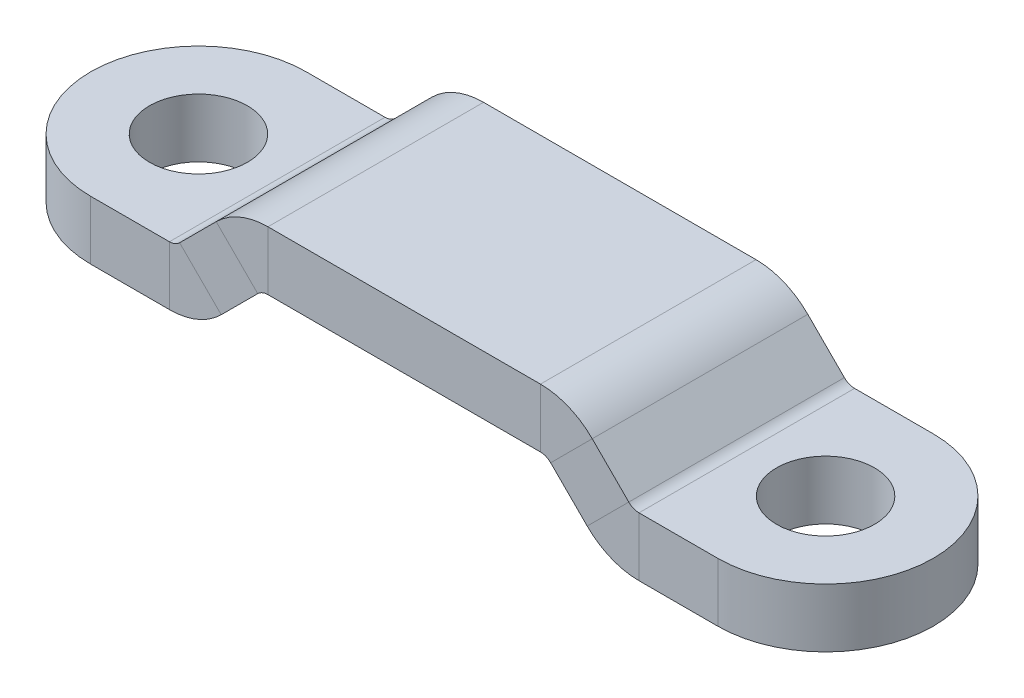
ISO-10303-21;
HEADER;
FILE_DESCRIPTION(('STEP AP214'),'2;1');
FILE_NAME('part.step','',(''),(''),'','','');
FILE_SCHEMA(('AUTOMOTIVE_DESIGN { 1 0 10303 214 1 1 1 1 }'));
ENDSEC;
DATA;
#1=APPLICATION_CONTEXT('core data for automotive mechanical design processes');
#2=APPLICATION_PROTOCOL_DEFINITION('international standard','automotive_design',2000,#1);
#3=PRODUCT_CONTEXT('',#1,'mechanical');
#4=PRODUCT('Part','Part','',(#3));
#5=PRODUCT_RELATED_PRODUCT_CATEGORY('part','',(#4));
#6=PRODUCT_DEFINITION_FORMATION('','',#4);
#7=PRODUCT_DEFINITION_CONTEXT('part definition',#1,'design');
#8=PRODUCT_DEFINITION('design','',#6,#7);
#9=PRODUCT_DEFINITION_SHAPE('','',#8);
#10=(LENGTH_UNIT() NAMED_UNIT(*) SI_UNIT(.MILLI.,.METRE.));
#11=(NAMED_UNIT(*) PLANE_ANGLE_UNIT() SI_UNIT($,.RADIAN.));
#12=(NAMED_UNIT(*) SI_UNIT($,.STERADIAN.) SOLID_ANGLE_UNIT());
#13=UNCERTAINTY_MEASURE_WITH_UNIT(LENGTH_MEASURE(1.E-05),#10,'distance_accuracy_value','');
#14=(GEOMETRIC_REPRESENTATION_CONTEXT(3) GLOBAL_UNCERTAINTY_ASSIGNED_CONTEXT((#13)) GLOBAL_UNIT_ASSIGNED_CONTEXT((#10,
#11,#12)) REPRESENTATION_CONTEXT('',''));
#15=CARTESIAN_POINT('',(0.,0.,0.));
#16=DIRECTION('',(0.,0.,1.));
#17=DIRECTION('',(1.,0.,0.));
#18=AXIS2_PLACEMENT_3D('',#15,#16,#17);
#19=CARTESIAN_POINT('',(-16.,3.,-5.5));
#20=DIRECTION('',(0.,0.,1.));
#21=DIRECTION('',(1.,0.,0.));
#22=AXIS2_PLACEMENT_3D('',#19,#20,#21);
#23=PLANE('',#22);
#24=DIRECTION('',(-1.,0.,0.));
#25=VECTOR('',#24,1.);
#26=CARTESIAN_POINT('',(-16.,3.,-5.5));
#27=LINE('',#26,#25);
#28=CARTESIAN_POINT('',(6.95224960283671,3.,-5.50000000000001));
#29=VERTEX_POINT('',#28);
#30=CARTESIAN_POINT('',(-6.9522496028367,3.,-5.5));
#31=VERTEX_POINT('',#30);
#32=EDGE_CURVE('E336',#29,#31,#27,.T.);
#33=ORIENTED_EDGE('',*,*,#32,.F.);
#34=DIRECTION('',(0.,-1.,0.));
#35=VECTOR('',#34,1.);
#36=CARTESIAN_POINT('',(6.95224960283671,3.,-5.5));
#37=LINE('',#36,#35);
#38=CARTESIAN_POINT('',(6.95224960283671,0.,-5.5));
#39=VERTEX_POINT('',#38);
#40=EDGE_CURVE('E386',#29,#39,#37,.T.);
#41=ORIENTED_EDGE('',*,*,#40,.T.);
#42=DIRECTION('',(-1.,0.,0.));
#43=VECTOR('',#42,1.);
#44=CARTESIAN_POINT('',(-16.,0.,-5.5));
#45=LINE('',#44,#43);
#46=CARTESIAN_POINT('',(-6.9522496028367,0.,-5.5));
#47=VERTEX_POINT('',#46);
#48=EDGE_CURVE('E378',#39,#47,#45,.T.);
#49=ORIENTED_EDGE('',*,*,#48,.T.);
#50=DIRECTION('',(0.,-1.,0.));
#51=VECTOR('',#50,1.);
#52=CARTESIAN_POINT('',(-6.9522496028367,3.,-5.5));
#53=LINE('',#52,#51);
#54=EDGE_CURVE('E327',#31,#47,#53,.T.);
#55=ORIENTED_EDGE('',*,*,#54,.F.);
#56=EDGE_LOOP('',(#33,#41,#49,#55));
#57=FACE_BOUND('',#56,.T.);
#58=ADVANCED_FACE('F49',(#57),#23,.F.);
#59=CARTESIAN_POINT('',(-16.,0.,0.));
#60=DIRECTION('',(0.,1.,0.));
#61=DIRECTION('',(0.,0.,1.));
#62=AXIS2_PLACEMENT_3D('',#59,#60,#61);
#63=PLANE('',#62);
#64=ORIENTED_EDGE('',*,*,#48,.F.);
#65=DIRECTION('',(0.,0.,1.));
#66=VECTOR('',#65,1.);
#67=CARTESIAN_POINT('',(6.95224960283671,0.,0.));
#68=LINE('',#67,#66);
#69=CARTESIAN_POINT('',(6.95224960283671,0.,5.49999999999999));
#70=VERTEX_POINT('',#69);
#71=EDGE_CURVE('E383',#39,#70,#68,.T.);
#72=ORIENTED_EDGE('',*,*,#71,.T.);
#73=DIRECTION('',(1.,0.,0.));
#74=VECTOR('',#73,1.);
#75=CARTESIAN_POINT('',(-16.,0.,5.5));
#76=LINE('',#75,#74);
#77=CARTESIAN_POINT('',(-6.9522496028367,0.,5.5));
#78=VERTEX_POINT('',#77);
#79=EDGE_CURVE('E391',#78,#70,#76,.T.);
#80=ORIENTED_EDGE('',*,*,#79,.F.);
#81=DIRECTION('',(0.,0.,1.));
#82=VECTOR('',#81,1.);
#83=CARTESIAN_POINT('',(-6.9522496028367,0.,0.));
#84=LINE('',#83,#82);
#85=EDGE_CURVE('E340',#47,#78,#84,.T.);
#86=ORIENTED_EDGE('',*,*,#85,.F.);
#87=EDGE_LOOP('',(#64,#72,#80,#86));
#88=FACE_BOUND('',#87,.T.);
#89=ADVANCED_FACE('F446',(#88),#63,.F.);
#90=CARTESIAN_POINT('',(-16.,3.,5.5));
#91=DIRECTION('',(0.,0.,-1.));
#92=DIRECTION('',(-1.,0.,0.));
#93=AXIS2_PLACEMENT_3D('',#90,#91,#92);
#94=PLANE('',#93);
#95=ORIENTED_EDGE('',*,*,#79,.T.);
#96=DIRECTION('',(0.,1.,0.));
#97=VECTOR('',#96,1.);
#98=CARTESIAN_POINT('',(6.95224960283671,3.,5.5));
#99=LINE('',#98,#97);
#100=CARTESIAN_POINT('',(6.95224960283671,3.,5.49999999999999));
#101=VERTEX_POINT('',#100);
#102=EDGE_CURVE('E380',#70,#101,#99,.T.);
#103=ORIENTED_EDGE('',*,*,#102,.T.);
#104=DIRECTION('',(1.,0.,0.));
#105=VECTOR('',#104,1.);
#106=CARTESIAN_POINT('',(-16.,3.,5.5));
#107=LINE('',#106,#105);
#108=CARTESIAN_POINT('',(-6.9522496028367,3.,5.5));
#109=VERTEX_POINT('',#108);
#110=EDGE_CURVE('E335',#109,#101,#107,.T.);
#111=ORIENTED_EDGE('',*,*,#110,.F.);
#112=DIRECTION('',(0.,1.,0.));
#113=VECTOR('',#112,1.);
#114=CARTESIAN_POINT('',(-6.9522496028367,3.,5.5));
#115=LINE('',#114,#113);
#116=EDGE_CURVE('E337',#78,#109,#115,.T.);
#117=ORIENTED_EDGE('',*,*,#116,.F.);
#118=EDGE_LOOP('',(#95,#103,#111,#117));
#119=FACE_BOUND('',#118,.T.);
#120=ADVANCED_FACE('F452',(#119),#94,.F.);
#121=CARTESIAN_POINT('',(-14.7500314643002,-3.25003146430018,0.));
#122=DIRECTION('',(-0.707106781186549,0.707106781186546,0.));
#123=DIRECTION('',(0.,0.,1.));
#124=AXIS2_PLACEMENT_3D('',#121,#122,#123);
#125=PLANE('',#124);
#126=DIRECTION('',(-0.707106781186546,-0.707106781186549,0.));
#127=VECTOR('',#126,1.);
#128=CARTESIAN_POINT('',(-14.7500314643002,-3.25003146430018,-5.5));
#129=LINE('',#128,#127);
#130=CARTESIAN_POINT('',(-9.59442480141836,1.90557519858165,-5.5));
#131=VERTEX_POINT('',#130);
#132=CARTESIAN_POINT('',(-11.459254855022,0.0407451449779793,-5.5));
#133=VERTEX_POINT('',#132);
#134=EDGE_CURVE('E376',#131,#133,#129,.T.);
#135=ORIENTED_EDGE('',*,*,#134,.T.);
#136=DIRECTION('',(0.,0.,1.));
#137=VECTOR('',#136,1.);
#138=CARTESIAN_POINT('',(-11.459254855022,0.0407451449779793,0.));
#139=LINE('',#138,#137);
#140=CARTESIAN_POINT('',(-11.459254855022,0.0407451449779785,5.5));
#141=VERTEX_POINT('',#140);
#142=EDGE_CURVE('E357',#133,#141,#139,.T.);
#143=ORIENTED_EDGE('',*,*,#142,.T.);
#144=DIRECTION('',(0.707106781186546,0.707106781186549,0.));
#145=VECTOR('',#144,1.);
#146=CARTESIAN_POINT('',(-14.7500314643002,-3.25003146430018,5.5));
#147=LINE('',#146,#145);
#148=CARTESIAN_POINT('',(-9.59442480141836,1.90557519858165,5.5));
#149=VERTEX_POINT('',#148);
#150=EDGE_CURVE('E372',#141,#149,#147,.T.);
#151=ORIENTED_EDGE('',*,*,#150,.T.);
#152=DIRECTION('',(0.,0.,1.));
#153=VECTOR('',#152,1.);
#154=CARTESIAN_POINT('',(-9.59442480141836,1.90557519858165,0.));
#155=LINE('',#154,#153);
#156=EDGE_CURVE('E345',#131,#149,#155,.T.);
#157=ORIENTED_EDGE('',*,*,#156,.F.);
#158=EDGE_LOOP('',(#135,#143,#151,#157));
#159=FACE_BOUND('',#158,.T.);
#160=ADVANCED_FACE('F462',(#159),#125,.T.);
#161=CARTESIAN_POINT('',(-12.6287111207405,-5.37135180785982,0.));
#162=DIRECTION('',(-0.707106781186549,0.707106781186546,0.));
#163=DIRECTION('',(0.,0.,1.));
#164=AXIS2_PLACEMENT_3D('',#161,#162,#163);
#165=PLANE('',#164);
#166=DIRECTION('',(0.,0.,1.));
#167=VECTOR('',#166,1.);
#168=CARTESIAN_POINT('',(-9.33793451146238,-2.08057519858166,0.));
#169=LINE('',#168,#167);
#170=CARTESIAN_POINT('',(-9.33793451146238,-2.08057519858166,-5.5));
#171=VERTEX_POINT('',#170);
#172=CARTESIAN_POINT('',(-9.33793451146238,-2.08057519858166,5.5));
#173=VERTEX_POINT('',#172);
#174=EDGE_CURVE('E363',#171,#173,#169,.T.);
#175=ORIENTED_EDGE('',*,*,#174,.F.);
#176=DIRECTION('',(-0.707106781186546,-0.707106781186549,0.));
#177=VECTOR('',#176,1.);
#178=CARTESIAN_POINT('',(-12.6287111207405,-5.37135180785982,-5.5));
#179=LINE('',#178,#177);
#180=CARTESIAN_POINT('',(-7.47310445785872,-0.21574514497799,-5.5));
#181=VERTEX_POINT('',#180);
#182=EDGE_CURVE('E349',#181,#171,#179,.T.);
#183=ORIENTED_EDGE('',*,*,#182,.F.);
#184=DIRECTION('',(0.,0.,1.));
#185=VECTOR('',#184,1.);
#186=CARTESIAN_POINT('',(-7.47310445785872,-0.21574514497799,0.));
#187=LINE('',#186,#185);
#188=CARTESIAN_POINT('',(-7.47310445785872,-0.21574514497799,5.5));
#189=VERTEX_POINT('',#188);
#190=EDGE_CURVE('E351',#181,#189,#187,.T.);
#191=ORIENTED_EDGE('',*,*,#190,.T.);
#192=DIRECTION('',(0.707106781186546,0.707106781186549,0.));
#193=VECTOR('',#192,1.);
#194=CARTESIAN_POINT('',(-12.6287111207405,-5.37135180785982,5.5));
#195=LINE('',#194,#193);
#196=EDGE_CURVE('E370',#173,#189,#195,.T.);
#197=ORIENTED_EDGE('',*,*,#196,.F.);
#198=EDGE_LOOP('',(#175,#183,#191,#197));
#199=FACE_BOUND('',#198,.T.);
#200=ADVANCED_FACE('F508',(#199),#165,.F.);
#201=CARTESIAN_POINT('',(-14.7500314643002,-3.25003146430018,5.5));
#202=DIRECTION('',(0.,0.,-1.));
#203=DIRECTION('',(-0.707106781186546,-0.707106781186549,0.));
#204=AXIS2_PLACEMENT_3D('',#201,#202,#203);
#205=PLANE('',#204);
#206=DIRECTION('',(-0.707106781186549,0.707106781186546,0.));
#207=VECTOR('',#206,1.);
#208=CARTESIAN_POINT('',(-11.459254855022,0.0407451449779793,5.5));
#209=LINE('',#208,#207);
#210=EDGE_CURVE('E366',#173,#141,#209,.T.);
#211=ORIENTED_EDGE('',*,*,#210,.F.);
#212=ORIENTED_EDGE('',*,*,#196,.T.);
#213=DIRECTION('',(-0.707106781186549,0.707106781186546,0.));
#214=VECTOR('',#213,1.);
#215=CARTESIAN_POINT('',(-9.59442480141836,1.90557519858165,5.5));
#216=LINE('',#215,#214);
#217=EDGE_CURVE('E348',#189,#149,#216,.T.);
#218=ORIENTED_EDGE('',*,*,#217,.T.);
#219=ORIENTED_EDGE('',*,*,#150,.F.);
#220=EDGE_LOOP('',(#211,#212,#218,#219));
#221=FACE_BOUND('',#220,.T.);
#222=ADVANCED_FACE('F457',(#221),#205,.F.);
#223=CARTESIAN_POINT('',(-14.7500314643002,-3.25003146430018,-5.5));
#224=DIRECTION('',(0.,0.,1.));
#225=DIRECTION('',(0.707106781186546,0.707106781186549,0.));
#226=AXIS2_PLACEMENT_3D('',#223,#224,#225);
#227=PLANE('',#226);
#228=DIRECTION('',(0.707106781186549,-0.707106781186546,0.));
#229=VECTOR('',#228,1.);
#230=CARTESIAN_POINT('',(-11.459254855022,0.0407451449779793,-5.5));
#231=LINE('',#230,#229);
#232=EDGE_CURVE('E360',#133,#171,#231,.T.);
#233=ORIENTED_EDGE('',*,*,#232,.F.);
#234=ORIENTED_EDGE('',*,*,#134,.F.);
#235=DIRECTION('',(0.707106781186549,-0.707106781186546,0.));
#236=VECTOR('',#235,1.);
#237=CARTESIAN_POINT('',(-9.59442480141836,1.90557519858165,-5.5));
#238=LINE('',#237,#236);
#239=EDGE_CURVE('E354',#131,#181,#238,.T.);
#240=ORIENTED_EDGE('',*,*,#239,.T.);
#241=ORIENTED_EDGE('',*,*,#182,.T.);
#242=EDGE_LOOP('',(#233,#234,#240,#241));
#243=FACE_BOUND('',#242,.T.);
#244=ADVANCED_FACE('F468',(#243),#227,.F.);
#245=CARTESIAN_POINT('',(-16.,3.,0.));
#246=DIRECTION('',(0.,1.,0.));
#247=DIRECTION('',(0.,0.,1.));
#248=AXIS2_PLACEMENT_3D('',#245,#246,#247);
#249=PLANE('',#248);
#250=DIRECTION('',(0.,0.,1.));
#251=VECTOR('',#250,1.);
#252=CARTESIAN_POINT('',(6.95224960283671,3.,0.));
#253=LINE('',#252,#251);
#254=EDGE_CURVE('E369',#29,#101,#253,.T.);
#255=ORIENTED_EDGE('',*,*,#254,.F.);
#256=ORIENTED_EDGE('',*,*,#32,.T.);
#257=DIRECTION('',(0.,0.,1.));
#258=VECTOR('',#257,1.);
#259=CARTESIAN_POINT('',(-6.9522496028367,3.,0.));
#260=LINE('',#259,#258);
#261=EDGE_CURVE('E332',#31,#109,#260,.T.);
#262=ORIENTED_EDGE('',*,*,#261,.T.);
#263=ORIENTED_EDGE('',*,*,#110,.T.);
#264=EDGE_LOOP('',(#255,#256,#262,#263));
#265=FACE_BOUND('',#264,.T.);
#266=ADVANCED_FACE('F464',(#265),#249,.T.);
#267=CARTESIAN_POINT('',(-6.9522496028367,-0.7366,-5.5));
#268=DIRECTION('',(0.,0.,-1.));
#269=DIRECTION('',(-1.,0.,0.));
#270=AXIS2_PLACEMENT_3D('',#267,#268,#269);
#271=PLANE('',#270);
#272=ORIENTED_EDGE('',*,*,#54,.T.);
#273=CARTESIAN_POINT('',(-6.9522496028367,-0.7366,-5.5));
#274=DIRECTION('',(0.,0.,1.));
#275=DIRECTION('',(1.,0.,0.));
#276=AXIS2_PLACEMENT_3D('',#273,#274,#275);
#277=CIRCLE('',#276,0.7366);
#278=EDGE_CURVE('E315',#47,#181,#277,.T.);
#279=ORIENTED_EDGE('',*,*,#278,.T.);
#280=ORIENTED_EDGE('',*,*,#239,.F.);
#281=CARTESIAN_POINT('',(-6.9522496028367,-0.7366,-5.5));
#282=DIRECTION('',(0.,0.,1.));
#283=DIRECTION('',(1.,0.,0.));
#284=AXIS2_PLACEMENT_3D('',#281,#282,#283);
#285=CIRCLE('',#284,3.7366);
#286=EDGE_CURVE('E320',#31,#131,#285,.T.);
#287=ORIENTED_EDGE('',*,*,#286,.F.);
#288=EDGE_LOOP('',(#272,#279,#280,#287));
#289=FACE_BOUND('',#288,.T.);
#290=ADVANCED_FACE('F467',(#289),#271,.T.);
#291=CARTESIAN_POINT('',(-6.9522496028367,-0.7366,5.5));
#292=DIRECTION('',(0.,0.,1.));
#293=DIRECTION('',(1.,0.,0.));
#294=AXIS2_PLACEMENT_3D('',#291,#292,#293);
#295=PLANE('',#294);
#296=ORIENTED_EDGE('',*,*,#217,.F.);
#297=CARTESIAN_POINT('',(-6.9522496028367,-0.7366,5.5));
#298=DIRECTION('',(0.,0.,1.));
#299=DIRECTION('',(1.,0.,0.));
#300=AXIS2_PLACEMENT_3D('',#297,#298,#299);
#301=CIRCLE('',#300,0.7366);
#302=EDGE_CURVE('E324',#189,#78,#301,.F.);
#303=ORIENTED_EDGE('',*,*,#302,.T.);
#304=ORIENTED_EDGE('',*,*,#116,.T.);
#305=CARTESIAN_POINT('',(-6.9522496028367,-0.7366,5.5));
#306=DIRECTION('',(0.,0.,-1.));
#307=DIRECTION('',(-1.,0.,0.));
#308=AXIS2_PLACEMENT_3D('',#305,#306,#307);
#309=CIRCLE('',#308,3.7366);
#310=EDGE_CURVE('E323',#149,#109,#309,.T.);
#311=ORIENTED_EDGE('',*,*,#310,.F.);
#312=EDGE_LOOP('',(#296,#303,#304,#311));
#313=FACE_BOUND('',#312,.T.);
#314=ADVANCED_FACE('F512',(#313),#295,.T.);
#315=CARTESIAN_POINT('',(-6.9522496028367,-0.7366,-11.5362783950276));
#316=DIRECTION('',(0.,0.,1.));
#317=DIRECTION('',(1.,0.,0.));
#318=AXIS2_PLACEMENT_3D('',#315,#316,#317);
#319=CYLINDRICAL_SURFACE('',#318,3.7366);
#320=ORIENTED_EDGE('',*,*,#310,.T.);
#321=ORIENTED_EDGE('',*,*,#261,.F.);
#322=ORIENTED_EDGE('',*,*,#286,.T.);
#323=ORIENTED_EDGE('',*,*,#156,.T.);
#324=EDGE_LOOP('',(#320,#321,#322,#323));
#325=FACE_BOUND('',#324,.T.);
#326=ADVANCED_FACE('F518',(#325),#319,.T.);
#327=CARTESIAN_POINT('',(-6.9522496028367,-0.7366,-11.5362783950276));
#328=DIRECTION('',(0.,0.,1.));
#329=DIRECTION('',(1.,0.,0.));
#330=AXIS2_PLACEMENT_3D('',#327,#328,#329);
#331=CYLINDRICAL_SURFACE('',#330,0.7366);
#332=ORIENTED_EDGE('',*,*,#302,.F.);
#333=ORIENTED_EDGE('',*,*,#190,.F.);
#334=ORIENTED_EDGE('',*,*,#278,.F.);
#335=ORIENTED_EDGE('',*,*,#85,.T.);
#336=EDGE_LOOP('',(#332,#333,#334,#335));
#337=FACE_BOUND('',#336,.T.);
#338=ADVANCED_FACE('F504',(#337),#331,.F.);
#339=CARTESIAN_POINT('',(-11.980109710044,0.561599999999989,-5.5));
#340=DIRECTION('',(0.,0.,1.));
#341=DIRECTION('',(1.,0.,0.));
#342=AXIS2_PLACEMENT_3D('',#339,#340,#341);
#343=PLANE('',#342);
#344=ORIENTED_EDGE('',*,*,#232,.T.);
#345=CARTESIAN_POINT('',(-11.980109710044,0.561599999999989,-5.5));
#346=DIRECTION('',(0.,0.,1.));
#347=DIRECTION('',(1.,0.,0.));
#348=AXIS2_PLACEMENT_3D('',#345,#346,#347);
#349=CIRCLE('',#348,3.7366);
#350=CARTESIAN_POINT('',(-11.980109710044,-3.17500000000001,-5.5));
#351=VERTEX_POINT('',#350);
#352=EDGE_CURVE('E273',#171,#351,#349,.F.);
#353=ORIENTED_EDGE('',*,*,#352,.T.);
#354=DIRECTION('',(0.,-1.,0.));
#355=VECTOR('',#354,1.);
#356=CARTESIAN_POINT('',(-11.980109710044,-0.175000000000012,-5.5));
#357=LINE('',#356,#355);
#358=CARTESIAN_POINT('',(-11.980109710044,-0.175000000000012,-5.5));
#359=VERTEX_POINT('',#358);
#360=EDGE_CURVE('E286',#359,#351,#357,.T.);
#361=ORIENTED_EDGE('',*,*,#360,.F.);
#362=CARTESIAN_POINT('',(-11.980109710044,0.561599999999989,-5.5));
#363=DIRECTION('',(0.,0.,-1.));
#364=DIRECTION('',(-1.,0.,0.));
#365=AXIS2_PLACEMENT_3D('',#362,#363,#364);
#366=CIRCLE('',#365,0.7366);
#367=EDGE_CURVE('E308',#133,#359,#366,.T.);
#368=ORIENTED_EDGE('',*,*,#367,.F.);
#369=EDGE_LOOP('',(#344,#353,#361,#368));
#370=FACE_BOUND('',#369,.T.);
#371=ADVANCED_FACE('F525',(#370),#343,.F.);
#372=CARTESIAN_POINT('',(-11.980109710044,0.561599999999989,5.5));
#373=DIRECTION('',(0.,0.,-1.));
#374=DIRECTION('',(-1.,0.,0.));
#375=AXIS2_PLACEMENT_3D('',#372,#373,#374);
#376=PLANE('',#375);
#377=DIRECTION('',(0.,1.,0.));
#378=VECTOR('',#377,1.);
#379=CARTESIAN_POINT('',(-11.980109710044,-0.175000000000012,5.5));
#380=LINE('',#379,#378);
#381=CARTESIAN_POINT('',(-11.980109710044,-3.17500000000001,5.5));
#382=VERTEX_POINT('',#381);
#383=CARTESIAN_POINT('',(-11.980109710044,-0.175000000000011,5.5));
#384=VERTEX_POINT('',#383);
#385=EDGE_CURVE('E274',#382,#384,#380,.T.);
#386=ORIENTED_EDGE('',*,*,#385,.F.);
#387=CARTESIAN_POINT('',(-11.980109710044,0.561599999999989,5.5));
#388=DIRECTION('',(0.,0.,1.));
#389=DIRECTION('',(1.,0.,0.));
#390=AXIS2_PLACEMENT_3D('',#387,#388,#389);
#391=CIRCLE('',#390,3.7366);
#392=EDGE_CURVE('E312',#382,#173,#391,.T.);
#393=ORIENTED_EDGE('',*,*,#392,.T.);
#394=ORIENTED_EDGE('',*,*,#210,.T.);
#395=CARTESIAN_POINT('',(-11.980109710044,0.561599999999989,5.5));
#396=DIRECTION('',(0.,0.,1.));
#397=DIRECTION('',(1.,0.,0.));
#398=AXIS2_PLACEMENT_3D('',#395,#396,#397);
#399=CIRCLE('',#398,0.7366);
#400=EDGE_CURVE('E311',#384,#141,#399,.T.);
#401=ORIENTED_EDGE('',*,*,#400,.F.);
#402=EDGE_LOOP('',(#386,#393,#394,#401));
#403=FACE_BOUND('',#402,.T.);
#404=ADVANCED_FACE('F585',(#403),#376,.F.);
#405=CARTESIAN_POINT('',(-11.980109710044,0.561599999999989,-11.9843835219468));
#406=DIRECTION('',(0.,0.,1.));
#407=DIRECTION('',(1.,0.,0.));
#408=AXIS2_PLACEMENT_3D('',#405,#406,#407);
#409=CYLINDRICAL_SURFACE('',#408,0.7366);
#410=ORIENTED_EDGE('',*,*,#400,.T.);
#411=ORIENTED_EDGE('',*,*,#142,.F.);
#412=ORIENTED_EDGE('',*,*,#367,.T.);
#413=DIRECTION('',(0.,0.,1.));
#414=VECTOR('',#413,1.);
#415=CARTESIAN_POINT('',(-11.980109710044,-0.175000000000012,0.));
#416=LINE('',#415,#414);
#417=EDGE_CURVE('E265',#359,#384,#416,.T.);
#418=ORIENTED_EDGE('',*,*,#417,.T.);
#419=EDGE_LOOP('',(#410,#411,#412,#418));
#420=FACE_BOUND('',#419,.T.);
#421=ADVANCED_FACE('F595',(#420),#409,.F.);
#422=CARTESIAN_POINT('',(-11.980109710044,0.561599999999989,-11.9843835219468));
#423=DIRECTION('',(0.,0.,1.));
#424=DIRECTION('',(1.,0.,0.));
#425=AXIS2_PLACEMENT_3D('',#422,#423,#424);
#426=CYLINDRICAL_SURFACE('',#425,3.7366);
#427=ORIENTED_EDGE('',*,*,#392,.F.);
#428=DIRECTION('',(0.,0.,1.));
#429=VECTOR('',#428,1.);
#430=CARTESIAN_POINT('',(-11.980109710044,-3.17500000000001,0.));
#431=LINE('',#430,#429);
#432=EDGE_CURVE('E278',#351,#382,#431,.T.);
#433=ORIENTED_EDGE('',*,*,#432,.F.);
#434=ORIENTED_EDGE('',*,*,#352,.F.);
#435=ORIENTED_EDGE('',*,*,#174,.T.);
#436=EDGE_LOOP('',(#427,#433,#434,#435));
#437=FACE_BOUND('',#436,.T.);
#438=ADVANCED_FACE('F605',(#437),#426,.T.);
#439=CARTESIAN_POINT('',(-16.,-0.17500000000001,0.));
#440=DIRECTION('',(0.,-1.,0.));
#441=DIRECTION('',(0.,0.,-1.));
#442=AXIS2_PLACEMENT_3D('',#439,#440,#441);
#443=CYLINDRICAL_SURFACE('',#442,2.5);
#444=CARTESIAN_POINT('',(-16.,-0.17500000000001,0.));
#445=DIRECTION('',(0.,1.,0.));
#446=DIRECTION('',(0.,0.,1.));
#447=AXIS2_PLACEMENT_3D('',#444,#445,#446);
#448=CIRCLE('',#447,2.5);
#449=CARTESIAN_POINT('',(-16.,-0.17500000000001,2.5));
#450=VERTEX_POINT('',#449);
#451=EDGE_CURVE('E303',#450,#450,#448,.T.);
#452=ORIENTED_EDGE('',*,*,#451,.T.);
#453=EDGE_LOOP('',(#452));
#454=FACE_BOUND('',#453,.T.);
#455=CARTESIAN_POINT('',(-16.,-3.17500000000001,0.));
#456=DIRECTION('',(0.,1.,0.));
#457=DIRECTION('',(0.,0.,1.));
#458=AXIS2_PLACEMENT_3D('',#455,#456,#457);
#459=CIRCLE('',#458,2.5);
#460=CARTESIAN_POINT('',(-16.,-3.17500000000001,2.5));
#461=VERTEX_POINT('',#460);
#462=EDGE_CURVE('E281',#461,#461,#459,.T.);
#463=ORIENTED_EDGE('',*,*,#462,.F.);
#464=EDGE_LOOP('',(#463));
#465=FACE_BOUND('',#464,.T.);
#466=ADVANCED_FACE('F616',(#454,#465),#443,.F.);
#467=CARTESIAN_POINT('',(-16.,-0.17500000000001,0.));
#468=DIRECTION('',(0.,-1.,0.));
#469=DIRECTION('',(0.,0.,-1.));
#470=AXIS2_PLACEMENT_3D('',#467,#468,#469);
#471=CYLINDRICAL_SURFACE('',#470,5.5);
#472=CARTESIAN_POINT('',(-16.,-3.17500000000001,0.));
#473=DIRECTION('',(0.,1.,0.));
#474=DIRECTION('',(0.,0.,1.));
#475=AXIS2_PLACEMENT_3D('',#472,#473,#474);
#476=CIRCLE('',#475,5.5);
#477=CARTESIAN_POINT('',(-16.,-3.17500000000001,-5.5));
#478=VERTEX_POINT('',#477);
#479=CARTESIAN_POINT('',(-16.,-3.17500000000001,5.5));
#480=VERTEX_POINT('',#479);
#481=EDGE_CURVE('E300',#478,#480,#476,.T.);
#482=ORIENTED_EDGE('',*,*,#481,.T.);
#483=DIRECTION('',(0.,-1.,0.));
#484=VECTOR('',#483,1.);
#485=CARTESIAN_POINT('',(-16.,-0.17500000000001,5.5));
#486=LINE('',#485,#484);
#487=CARTESIAN_POINT('',(-16.,-0.17500000000001,5.5));
#488=VERTEX_POINT('',#487);
#489=EDGE_CURVE('E270',#488,#480,#486,.T.);
#490=ORIENTED_EDGE('',*,*,#489,.F.);
#491=CARTESIAN_POINT('',(-16.,-0.17500000000001,0.));
#492=DIRECTION('',(0.,1.,0.));
#493=DIRECTION('',(0.,0.,1.));
#494=AXIS2_PLACEMENT_3D('',#491,#492,#493);
#495=CIRCLE('',#494,5.5);
#496=CARTESIAN_POINT('',(-16.,-0.17500000000001,-5.5));
#497=VERTEX_POINT('',#496);
#498=EDGE_CURVE('E292',#497,#488,#495,.T.);
#499=ORIENTED_EDGE('',*,*,#498,.F.);
#500=DIRECTION('',(0.,-1.,0.));
#501=VECTOR('',#500,1.);
#502=CARTESIAN_POINT('',(-16.,-0.17500000000001,-5.5));
#503=LINE('',#502,#501);
#504=EDGE_CURVE('E297',#497,#478,#503,.T.);
#505=ORIENTED_EDGE('',*,*,#504,.T.);
#506=EDGE_LOOP('',(#482,#490,#499,#505));
#507=FACE_BOUND('',#506,.T.);
#508=ADVANCED_FACE('F630',(#507),#471,.T.);
#509=CARTESIAN_POINT('',(-14.8773490893706,-0.175000000000012,0.));
#510=DIRECTION('',(0.,1.,0.));
#511=DIRECTION('',(0.,0.,1.));
#512=AXIS2_PLACEMENT_3D('',#509,#510,#511);
#513=PLANE('',#512);
#514=ORIENTED_EDGE('',*,*,#417,.F.);
#515=DIRECTION('',(-1.,0.,0.));
#516=VECTOR('',#515,1.);
#517=CARTESIAN_POINT('',(-14.8773490893706,-0.175000000000012,-5.5));
#518=LINE('',#517,#516);
#519=EDGE_CURVE('E295',#359,#497,#518,.T.);
#520=ORIENTED_EDGE('',*,*,#519,.T.);
#521=ORIENTED_EDGE('',*,*,#498,.T.);
#522=DIRECTION('',(1.,0.,0.));
#523=VECTOR('',#522,1.);
#524=CARTESIAN_POINT('',(-14.8773490893706,-0.175000000000012,5.5));
#525=LINE('',#524,#523);
#526=EDGE_CURVE('E289',#488,#384,#525,.T.);
#527=ORIENTED_EDGE('',*,*,#526,.T.);
#528=EDGE_LOOP('',(#514,#520,#521,#527));
#529=FACE_BOUND('',#528,.T.);
#530=ORIENTED_EDGE('',*,*,#451,.F.);
#531=EDGE_LOOP('',(#530));
#532=FACE_BOUND('',#531,.T.);
#533=ADVANCED_FACE('F625',(#529,#532),#513,.T.);
#534=CARTESIAN_POINT('',(-14.8773490893706,-0.175000000000012,-5.5));
#535=DIRECTION('',(0.,0.,1.));
#536=DIRECTION('',(1.,0.,0.));
#537=AXIS2_PLACEMENT_3D('',#534,#535,#536);
#538=PLANE('',#537);
#539=ORIENTED_EDGE('',*,*,#519,.F.);
#540=ORIENTED_EDGE('',*,*,#360,.T.);
#541=DIRECTION('',(-1.,0.,0.));
#542=VECTOR('',#541,1.);
#543=CARTESIAN_POINT('',(-14.8773490893706,-3.17500000000001,-5.5));
#544=LINE('',#543,#542);
#545=EDGE_CURVE('E284',#351,#478,#544,.T.);
#546=ORIENTED_EDGE('',*,*,#545,.T.);
#547=ORIENTED_EDGE('',*,*,#504,.F.);
#548=EDGE_LOOP('',(#539,#540,#546,#547));
#549=FACE_BOUND('',#548,.T.);
#550=ADVANCED_FACE('F629',(#549),#538,.F.);
#551=CARTESIAN_POINT('',(-14.8773490893706,-3.17500000000001,0.));
#552=DIRECTION('',(0.,1.,0.));
#553=DIRECTION('',(0.,0.,1.));
#554=AXIS2_PLACEMENT_3D('',#551,#552,#553);
#555=PLANE('',#554);
#556=ORIENTED_EDGE('',*,*,#462,.T.);
#557=EDGE_LOOP('',(#556));
#558=FACE_BOUND('',#557,.T.);
#559=ORIENTED_EDGE('',*,*,#545,.F.);
#560=ORIENTED_EDGE('',*,*,#432,.T.);
#561=DIRECTION('',(1.,0.,0.));
#562=VECTOR('',#561,1.);
#563=CARTESIAN_POINT('',(-14.8773490893706,-3.17500000000001,5.5));
#564=LINE('',#563,#562);
#565=EDGE_CURVE('E276',#480,#382,#564,.T.);
#566=ORIENTED_EDGE('',*,*,#565,.F.);
#567=ORIENTED_EDGE('',*,*,#481,.F.);
#568=EDGE_LOOP('',(#559,#560,#566,#567));
#569=FACE_BOUND('',#568,.T.);
#570=ADVANCED_FACE('F640',(#558,#569),#555,.F.);
#571=CARTESIAN_POINT('',(-14.8773490893706,-0.175000000000012,5.5));
#572=DIRECTION('',(0.,0.,-1.));
#573=DIRECTION('',(-1.,0.,0.));
#574=AXIS2_PLACEMENT_3D('',#571,#572,#573);
#575=PLANE('',#574);
#576=ORIENTED_EDGE('',*,*,#565,.T.);
#577=ORIENTED_EDGE('',*,*,#385,.T.);
#578=ORIENTED_EDGE('',*,*,#526,.F.);
#579=ORIENTED_EDGE('',*,*,#489,.T.);
#580=EDGE_LOOP('',(#576,#577,#578,#579));
#581=FACE_BOUND('',#580,.T.);
#582=ADVANCED_FACE('F644',(#581),#575,.F.);
#583=CARTESIAN_POINT('',(6.95224960283671,-0.7366,-5.50000000000001));
#584=DIRECTION('',(0.,0.,-1.));
#585=DIRECTION('',(-1.,0.,0.));
#586=AXIS2_PLACEMENT_3D('',#583,#584,#585);
#587=PLANE('',#586);
#588=DIRECTION('',(-0.707106781186549,-0.707106781186546,0.));
#589=VECTOR('',#588,1.);
#590=CARTESIAN_POINT('',(9.59442480141836,1.90557519858165,-5.5));
#591=LINE('',#590,#589);
#592=CARTESIAN_POINT('',(9.59442480141836,1.90557519858165,-5.50000000000001));
#593=VERTEX_POINT('',#592);
#594=CARTESIAN_POINT('',(7.47310445785872,-0.21574514497799,-5.5));
#595=VERTEX_POINT('',#594);
#596=EDGE_CURVE('E244',#593,#595,#591,.T.);
#597=ORIENTED_EDGE('',*,*,#596,.T.);
#598=CARTESIAN_POINT('',(6.95224960283671,-0.7366,-5.50000000000001));
#599=DIRECTION('',(0.,0.,-1.));
#600=DIRECTION('',(-1.,0.,0.));
#601=AXIS2_PLACEMENT_3D('',#598,#599,#600);
#602=CIRCLE('',#601,0.7366);
#603=EDGE_CURVE('E74',#595,#39,#602,.F.);
#604=ORIENTED_EDGE('',*,*,#603,.T.);
#605=ORIENTED_EDGE('',*,*,#40,.F.);
#606=CARTESIAN_POINT('',(6.95224960283671,-0.7366,-5.50000000000001));
#607=DIRECTION('',(0.,0.,1.));
#608=DIRECTION('',(1.,0.,0.));
#609=AXIS2_PLACEMENT_3D('',#606,#607,#608);
#610=CIRCLE('',#609,3.7366);
#611=EDGE_CURVE('E258',#593,#29,#610,.T.);
#612=ORIENTED_EDGE('',*,*,#611,.F.);
#613=EDGE_LOOP('',(#597,#604,#605,#612));
#614=FACE_BOUND('',#613,.T.);
#615=ADVANCED_FACE('F487',(#614),#587,.T.);
#616=CARTESIAN_POINT('',(6.95224960283671,-0.7366,5.5));
#617=DIRECTION('',(0.,0.,1.));
#618=DIRECTION('',(1.,0.,0.));
#619=AXIS2_PLACEMENT_3D('',#616,#617,#618);
#620=PLANE('',#619);
#621=CARTESIAN_POINT('',(6.95224960283671,-0.7366,5.49999999999999));
#622=DIRECTION('',(0.,0.,-1.));
#623=DIRECTION('',(-1.,0.,0.));
#624=AXIS2_PLACEMENT_3D('',#621,#622,#623);
#625=CIRCLE('',#624,0.7366);
#626=CARTESIAN_POINT('',(7.47310445785872,-0.21574514497799,5.5));
#627=VERTEX_POINT('',#626);
#628=EDGE_CURVE('E262',#70,#627,#625,.T.);
#629=ORIENTED_EDGE('',*,*,#628,.T.);
#630=DIRECTION('',(0.707106781186549,0.707106781186546,0.));
#631=VECTOR('',#630,1.);
#632=CARTESIAN_POINT('',(9.59442480141836,1.90557519858165,5.5));
#633=LINE('',#632,#631);
#634=CARTESIAN_POINT('',(9.59442480141836,1.90557519858165,5.5));
#635=VERTEX_POINT('',#634);
#636=EDGE_CURVE('E251',#627,#635,#633,.T.);
#637=ORIENTED_EDGE('',*,*,#636,.T.);
#638=CARTESIAN_POINT('',(6.95224960283671,-0.7366,5.5));
#639=DIRECTION('',(0.,0.,-1.));
#640=DIRECTION('',(-1.,0.,0.));
#641=AXIS2_PLACEMENT_3D('',#638,#639,#640);
#642=CIRCLE('',#641,3.7366);
#643=EDGE_CURVE('E261',#101,#635,#642,.T.);
#644=ORIENTED_EDGE('',*,*,#643,.F.);
#645=ORIENTED_EDGE('',*,*,#102,.F.);
#646=EDGE_LOOP('',(#629,#637,#644,#645));
#647=FACE_BOUND('',#646,.T.);
#648=ADVANCED_FACE('F494',(#647),#620,.T.);
#649=CARTESIAN_POINT('',(6.95224960283671,-0.7366,11.5362783950276));
#650=DIRECTION('',(0.,0.,-1.));
#651=DIRECTION('',(-1.,0.,0.));
#652=AXIS2_PLACEMENT_3D('',#649,#650,#651);
#653=CYLINDRICAL_SURFACE('',#652,3.7366);
#654=ORIENTED_EDGE('',*,*,#254,.T.);
#655=ORIENTED_EDGE('',*,*,#643,.T.);
#656=DIRECTION('',(0.,0.,1.));
#657=VECTOR('',#656,1.);
#658=CARTESIAN_POINT('',(9.59442480141836,1.90557519858165,0.));
#659=LINE('',#658,#657);
#660=EDGE_CURVE('E248',#593,#635,#659,.T.);
#661=ORIENTED_EDGE('',*,*,#660,.F.);
#662=ORIENTED_EDGE('',*,*,#611,.T.);
#663=EDGE_LOOP('',(#654,#655,#661,#662));
#664=FACE_BOUND('',#663,.T.);
#665=ADVANCED_FACE('F484',(#664),#653,.T.);
#666=CARTESIAN_POINT('',(6.95224960283671,-0.7366,11.5362783950276));
#667=DIRECTION('',(0.,0.,-1.));
#668=DIRECTION('',(-1.,0.,0.));
#669=AXIS2_PLACEMENT_3D('',#666,#667,#668);
#670=CYLINDRICAL_SURFACE('',#669,0.7366);
#671=ORIENTED_EDGE('',*,*,#71,.F.);
#672=ORIENTED_EDGE('',*,*,#603,.F.);
#673=DIRECTION('',(0.,0.,1.));
#674=VECTOR('',#673,1.);
#675=CARTESIAN_POINT('',(7.47310445785872,-0.21574514497799,0.));
#676=LINE('',#675,#674);
#677=EDGE_CURVE('E254',#595,#627,#676,.T.);
#678=ORIENTED_EDGE('',*,*,#677,.T.);
#679=ORIENTED_EDGE('',*,*,#628,.F.);
#680=EDGE_LOOP('',(#671,#672,#678,#679));
#681=FACE_BOUND('',#680,.T.);
#682=ADVANCED_FACE('F472',(#681),#670,.F.);
#683=CARTESIAN_POINT('',(-7.87738553366931,19.3773855336694,0.));
#684=DIRECTION('',(0.707106781186549,0.707106781186546,0.));
#685=DIRECTION('',(0.,0.,1.));
#686=AXIS2_PLACEMENT_3D('',#683,#684,#685);
#687=PLANE('',#686);
#688=DIRECTION('',(0.,0.,1.));
#689=VECTOR('',#688,1.);
#690=CARTESIAN_POINT('',(11.459254855022,0.0407451449779776,0.));
#691=LINE('',#690,#689);
#692=CARTESIAN_POINT('',(11.459254855022,0.0407451449779773,-5.5));
#693=VERTEX_POINT('',#692);
#694=CARTESIAN_POINT('',(11.459254855022,0.0407451449779772,5.49999999999999));
#695=VERTEX_POINT('',#694);
#696=EDGE_CURVE('E389',#693,#695,#691,.T.);
#697=ORIENTED_EDGE('',*,*,#696,.F.);
#698=DIRECTION('',(-0.707106781186546,0.707106781186549,0.));
#699=VECTOR('',#698,1.);
#700=CARTESIAN_POINT('',(-7.87738553366931,19.3773855336694,-5.5));
#701=LINE('',#700,#699);
#702=EDGE_CURVE('E53',#693,#593,#701,.T.);
#703=ORIENTED_EDGE('',*,*,#702,.T.);
#704=ORIENTED_EDGE('',*,*,#660,.T.);
#705=DIRECTION('',(0.707106781186546,-0.707106781186549,0.));
#706=VECTOR('',#705,1.);
#707=CARTESIAN_POINT('',(-7.87738553366931,19.3773855336694,5.5));
#708=LINE('',#707,#706);
#709=EDGE_CURVE('E250',#635,#695,#708,.T.);
#710=ORIENTED_EDGE('',*,*,#709,.T.);
#711=EDGE_LOOP('',(#697,#703,#704,#710));
#712=FACE_BOUND('',#711,.T.);
#713=ADVANCED_FACE('F410',(#712),#687,.T.);
#714=CARTESIAN_POINT('',(-7.87738553366931,19.3773855336694,5.5));
#715=DIRECTION('',(0.,0.,-1.));
#716=DIRECTION('',(-0.707106781186546,0.707106781186549,0.));
#717=AXIS2_PLACEMENT_3D('',#714,#715,#716);
#718=PLANE('',#717);
#719=DIRECTION('',(0.707106781186546,-0.707106781186549,0.));
#720=VECTOR('',#719,1.);
#721=CARTESIAN_POINT('',(-9.99870587722896,17.2560651901097,5.5));
#722=LINE('',#721,#720);
#723=CARTESIAN_POINT('',(9.33793451146239,-2.08057519858166,5.49999999999999));
#724=VERTEX_POINT('',#723);
#725=EDGE_CURVE('E404',#627,#724,#722,.T.);
#726=ORIENTED_EDGE('',*,*,#725,.T.);
#727=DIRECTION('',(0.707106781186549,0.707106781186546,0.));
#728=VECTOR('',#727,1.);
#729=CARTESIAN_POINT('',(11.459254855022,0.0407451449779776,5.49999999999999));
#730=LINE('',#729,#728);
#731=EDGE_CURVE('E398',#724,#695,#730,.T.);
#732=ORIENTED_EDGE('',*,*,#731,.T.);
#733=ORIENTED_EDGE('',*,*,#709,.F.);
#734=ORIENTED_EDGE('',*,*,#636,.F.);
#735=EDGE_LOOP('',(#726,#732,#733,#734));
#736=FACE_BOUND('',#735,.T.);
#737=ADVANCED_FACE('F416',(#736),#718,.F.);
#738=CARTESIAN_POINT('',(-9.99870587722896,17.2560651901097,0.));
#739=DIRECTION('',(0.707106781186549,0.707106781186546,0.));
#740=DIRECTION('',(0.,0.,1.));
#741=AXIS2_PLACEMENT_3D('',#738,#739,#740);
#742=PLANE('',#741);
#743=DIRECTION('',(-0.707106781186546,0.707106781186549,0.));
#744=VECTOR('',#743,1.);
#745=CARTESIAN_POINT('',(-9.99870587722896,17.2560651901097,-5.5));
#746=LINE('',#745,#744);
#747=CARTESIAN_POINT('',(9.33793451146238,-2.08057519858166,-5.50000000000001));
#748=VERTEX_POINT('',#747);
#749=EDGE_CURVE('E267',#748,#595,#746,.T.);
#750=ORIENTED_EDGE('',*,*,#749,.F.);
#751=DIRECTION('',(0.,0.,1.));
#752=VECTOR('',#751,1.);
#753=CARTESIAN_POINT('',(9.33793451146238,-2.08057519858166,0.));
#754=LINE('',#753,#752);
#755=EDGE_CURVE('E58',#748,#724,#754,.T.);
#756=ORIENTED_EDGE('',*,*,#755,.T.);
#757=ORIENTED_EDGE('',*,*,#725,.F.);
#758=ORIENTED_EDGE('',*,*,#677,.F.);
#759=EDGE_LOOP('',(#750,#756,#757,#758));
#760=FACE_BOUND('',#759,.T.);
#761=ADVANCED_FACE('F474',(#760),#742,.F.);
#762=CARTESIAN_POINT('',(-7.87738553366931,19.3773855336694,-5.5));
#763=DIRECTION('',(0.,0.,1.));
#764=DIRECTION('',(0.707106781186546,-0.707106781186549,0.));
#765=AXIS2_PLACEMENT_3D('',#762,#763,#764);
#766=PLANE('',#765);
#767=ORIENTED_EDGE('',*,*,#702,.F.);
#768=DIRECTION('',(-0.707106781186549,-0.707106781186546,0.));
#769=VECTOR('',#768,1.);
#770=CARTESIAN_POINT('',(11.459254855022,0.0407451449779776,-5.50000000000001));
#771=LINE('',#770,#769);
#772=EDGE_CURVE('E12',#693,#748,#771,.T.);
#773=ORIENTED_EDGE('',*,*,#772,.T.);
#774=ORIENTED_EDGE('',*,*,#749,.T.);
#775=ORIENTED_EDGE('',*,*,#596,.F.);
#776=EDGE_LOOP('',(#767,#773,#774,#775));
#777=FACE_BOUND('',#776,.T.);
#778=ADVANCED_FACE('F51',(#777),#766,.F.);
#779=CARTESIAN_POINT('',(11.980109710044,0.561599999999988,-5.5));
#780=DIRECTION('',(0.,0.,1.));
#781=DIRECTION('',(1.,0.,0.));
#782=AXIS2_PLACEMENT_3D('',#779,#780,#781);
#783=PLANE('',#782);
#784=DIRECTION('',(0.,-1.,0.));
#785=VECTOR('',#784,1.);
#786=CARTESIAN_POINT('',(11.980109710044,-0.17500000000001,-5.50000000000001));
#787=LINE('',#786,#785);
#788=CARTESIAN_POINT('',(11.980109710044,-0.175000000000012,-5.5));
#789=VERTEX_POINT('',#788);
#790=CARTESIAN_POINT('',(11.980109710044,-3.17500000000001,-5.50000000000001));
#791=VERTEX_POINT('',#790);
#792=EDGE_CURVE('E195',#789,#791,#787,.T.);
#793=ORIENTED_EDGE('',*,*,#792,.T.);
#794=CARTESIAN_POINT('',(11.980109710044,0.561599999999988,-5.5));
#795=DIRECTION('',(0.,0.,-1.));
#796=DIRECTION('',(-1.,0.,0.));
#797=AXIS2_PLACEMENT_3D('',#794,#795,#796);
#798=CIRCLE('',#797,3.7366);
#799=EDGE_CURVE('E66',#791,#748,#798,.T.);
#800=ORIENTED_EDGE('',*,*,#799,.T.);
#801=ORIENTED_EDGE('',*,*,#772,.F.);
#802=CARTESIAN_POINT('',(11.980109710044,0.561599999999988,-5.5));
#803=DIRECTION('',(0.,0.,-1.));
#804=DIRECTION('',(-1.,0.,0.));
#805=AXIS2_PLACEMENT_3D('',#802,#803,#804);
#806=CIRCLE('',#805,0.7366);
#807=EDGE_CURVE('E237',#789,#693,#806,.T.);
#808=ORIENTED_EDGE('',*,*,#807,.F.);
#809=EDGE_LOOP('',(#793,#800,#801,#808));
#810=FACE_BOUND('',#809,.T.);
#811=ADVANCED_FACE('F430',(#810),#783,.F.);
#812=CARTESIAN_POINT('',(11.980109710044,0.561599999999988,5.49999999999999));
#813=DIRECTION('',(0.,0.,-1.));
#814=DIRECTION('',(-1.,0.,0.));
#815=AXIS2_PLACEMENT_3D('',#812,#813,#814);
#816=PLANE('',#815);
#817=CARTESIAN_POINT('',(11.980109710044,0.561599999999988,5.49999999999999));
#818=DIRECTION('',(0.,0.,-1.));
#819=DIRECTION('',(-1.,0.,0.));
#820=AXIS2_PLACEMENT_3D('',#817,#818,#819);
#821=CIRCLE('',#820,3.7366);
#822=CARTESIAN_POINT('',(11.980109710044,-3.17500000000001,5.49999999999999));
#823=VERTEX_POINT('',#822);
#824=EDGE_CURVE('E241',#724,#823,#821,.F.);
#825=ORIENTED_EDGE('',*,*,#824,.T.);
#826=DIRECTION('',(0.,1.,0.));
#827=VECTOR('',#826,1.);
#828=CARTESIAN_POINT('',(11.980109710044,-0.17500000000001,5.49999999999999));
#829=LINE('',#828,#827);
#830=CARTESIAN_POINT('',(11.980109710044,-0.17500000000001,5.49999999999999));
#831=VERTEX_POINT('',#830);
#832=EDGE_CURVE('E230',#823,#831,#829,.T.);
#833=ORIENTED_EDGE('',*,*,#832,.T.);
#834=CARTESIAN_POINT('',(11.980109710044,0.561599999999988,5.49999999999999));
#835=DIRECTION('',(0.,0.,1.));
#836=DIRECTION('',(1.,0.,0.));
#837=AXIS2_PLACEMENT_3D('',#834,#835,#836);
#838=CIRCLE('',#837,0.7366);
#839=EDGE_CURVE('E240',#695,#831,#838,.T.);
#840=ORIENTED_EDGE('',*,*,#839,.F.);
#841=ORIENTED_EDGE('',*,*,#731,.F.);
#842=EDGE_LOOP('',(#825,#833,#840,#841));
#843=FACE_BOUND('',#842,.T.);
#844=ADVANCED_FACE('F420',(#843),#816,.F.);
#845=CARTESIAN_POINT('',(11.980109710044,0.561599999999988,11.9843835219468));
#846=DIRECTION('',(0.,0.,-1.));
#847=DIRECTION('',(-1.,0.,0.));
#848=AXIS2_PLACEMENT_3D('',#845,#846,#847);
#849=CYLINDRICAL_SURFACE('',#848,0.7366);
#850=ORIENTED_EDGE('',*,*,#696,.T.);
#851=ORIENTED_EDGE('',*,*,#839,.T.);
#852=DIRECTION('',(0.,0.,1.));
#853=VECTOR('',#852,1.);
#854=CARTESIAN_POINT('',(11.980109710044,-0.17500000000001,0.));
#855=LINE('',#854,#853);
#856=EDGE_CURVE('E198',#789,#831,#855,.T.);
#857=ORIENTED_EDGE('',*,*,#856,.F.);
#858=ORIENTED_EDGE('',*,*,#807,.T.);
#859=EDGE_LOOP('',(#850,#851,#857,#858));
#860=FACE_BOUND('',#859,.T.);
#861=ADVANCED_FACE('F432',(#860),#849,.F.);
#862=CARTESIAN_POINT('',(11.980109710044,0.561599999999988,11.9843835219468));
#863=DIRECTION('',(0.,0.,-1.));
#864=DIRECTION('',(-1.,0.,0.));
#865=AXIS2_PLACEMENT_3D('',#862,#863,#864);
#866=CYLINDRICAL_SURFACE('',#865,3.7366);
#867=ORIENTED_EDGE('',*,*,#755,.F.);
#868=ORIENTED_EDGE('',*,*,#799,.F.);
#869=DIRECTION('',(0.,0.,1.));
#870=VECTOR('',#869,1.);
#871=CARTESIAN_POINT('',(11.980109710044,-3.17500000000001,0.));
#872=LINE('',#871,#870);
#873=EDGE_CURVE('E233',#791,#823,#872,.T.);
#874=ORIENTED_EDGE('',*,*,#873,.T.);
#875=ORIENTED_EDGE('',*,*,#824,.F.);
#876=EDGE_LOOP('',(#867,#868,#874,#875));
#877=FACE_BOUND('',#876,.T.);
#878=ADVANCED_FACE('F422',(#877),#866,.T.);
#879=CARTESIAN_POINT('',(16.,-0.175000000000008,0.));
#880=DIRECTION('',(0.,-1.,0.));
#881=DIRECTION('',(0.,0.,-1.));
#882=AXIS2_PLACEMENT_3D('',#879,#880,#881);
#883=CYLINDRICAL_SURFACE('',#882,5.5);
#884=CARTESIAN_POINT('',(16.,-3.17500000000001,0.));
#885=DIRECTION('',(0.,1.,0.));
#886=DIRECTION('',(0.,0.,1.));
#887=AXIS2_PLACEMENT_3D('',#884,#885,#886);
#888=CIRCLE('',#887,5.5);
#889=CARTESIAN_POINT('',(16.,-3.17500000000001,5.49999999999999));
#890=VERTEX_POINT('',#889);
#891=CARTESIAN_POINT('',(16.,-3.17500000000001,-5.50000000000001));
#892=VERTEX_POINT('',#891);
#893=EDGE_CURVE('E214',#890,#892,#888,.T.);
#894=ORIENTED_EDGE('',*,*,#893,.T.);
#895=DIRECTION('',(0.,-1.,0.));
#896=VECTOR('',#895,1.);
#897=CARTESIAN_POINT('',(16.,-0.175000000000008,-5.50000000000001));
#898=LINE('',#897,#896);
#899=CARTESIAN_POINT('',(16.,-0.175000000000008,-5.50000000000001));
#900=VERTEX_POINT('',#899);
#901=EDGE_CURVE('E194',#900,#892,#898,.T.);
#902=ORIENTED_EDGE('',*,*,#901,.F.);
#903=CARTESIAN_POINT('',(16.,-0.175000000000008,0.));
#904=DIRECTION('',(0.,1.,0.));
#905=DIRECTION('',(0.,0.,1.));
#906=AXIS2_PLACEMENT_3D('',#903,#904,#905);
#907=CIRCLE('',#906,5.5);
#908=CARTESIAN_POINT('',(16.,-0.175000000000008,5.49999999999999));
#909=VERTEX_POINT('',#908);
#910=EDGE_CURVE('E202',#909,#900,#907,.T.);
#911=ORIENTED_EDGE('',*,*,#910,.F.);
#912=DIRECTION('',(0.,-1.,0.));
#913=VECTOR('',#912,1.);
#914=CARTESIAN_POINT('',(16.,-0.175000000000008,5.49999999999999));
#915=LINE('',#914,#913);
#916=EDGE_CURVE('E227',#909,#890,#915,.T.);
#917=ORIENTED_EDGE('',*,*,#916,.T.);
#918=EDGE_LOOP('',(#894,#902,#911,#917));
#919=FACE_BOUND('',#918,.T.);
#920=ADVANCED_FACE('F212',(#919),#883,.T.);
#921=CARTESIAN_POINT('',(16.,-0.175000000000008,0.));
#922=DIRECTION('',(0.,-1.,0.));
#923=DIRECTION('',(0.,0.,-1.));
#924=AXIS2_PLACEMENT_3D('',#921,#922,#923);
#925=CYLINDRICAL_SURFACE('',#924,2.5);
#926=CARTESIAN_POINT('',(16.,-0.175000000000008,0.));
#927=DIRECTION('',(0.,1.,0.));
#928=DIRECTION('',(0.,0.,1.));
#929=AXIS2_PLACEMENT_3D('',#926,#927,#928);
#930=CIRCLE('',#929,2.5);
#931=CARTESIAN_POINT('',(16.,-0.175000000000008,2.49999999999999));
#932=VERTEX_POINT('',#931);
#933=EDGE_CURVE('E199',#932,#932,#930,.T.);
#934=ORIENTED_EDGE('',*,*,#933,.T.);
#935=EDGE_LOOP('',(#934));
#936=FACE_BOUND('',#935,.T.);
#937=CARTESIAN_POINT('',(16.,-3.17500000000001,0.));
#938=DIRECTION('',(0.,1.,0.));
#939=DIRECTION('',(0.,0.,1.));
#940=AXIS2_PLACEMENT_3D('',#937,#938,#939);
#941=CIRCLE('',#940,2.5);
#942=CARTESIAN_POINT('',(16.,-3.17500000000001,2.49999999999999));
#943=VERTEX_POINT('',#942);
#944=EDGE_CURVE('E216',#943,#943,#941,.T.);
#945=ORIENTED_EDGE('',*,*,#944,.F.);
#946=EDGE_LOOP('',(#945));
#947=FACE_BOUND('',#946,.T.);
#948=ADVANCED_FACE('F442',(#936,#947),#925,.F.);
#949=CARTESIAN_POINT('',(-17.1226509106294,-0.175000000000012,0.));
#950=DIRECTION('',(0.,1.,0.));
#951=DIRECTION('',(0.,0.,1.));
#952=AXIS2_PLACEMENT_3D('',#949,#950,#951);
#953=PLANE('',#952);
#954=ORIENTED_EDGE('',*,*,#933,.F.);
#955=EDGE_LOOP('',(#954));
#956=FACE_BOUND('',#955,.T.);
#957=DIRECTION('',(-1.,0.,0.));
#958=VECTOR('',#957,1.);
#959=CARTESIAN_POINT('',(-17.1226509106294,-0.175000000000012,-5.5));
#960=LINE('',#959,#958);
#961=EDGE_CURVE('E190',#900,#789,#960,.T.);
#962=ORIENTED_EDGE('',*,*,#961,.T.);
#963=ORIENTED_EDGE('',*,*,#856,.T.);
#964=DIRECTION('',(1.,0.,0.));
#965=VECTOR('',#964,1.);
#966=CARTESIAN_POINT('',(-17.1226509106294,-0.175000000000012,5.5));
#967=LINE('',#966,#965);
#968=EDGE_CURVE('E205',#831,#909,#967,.T.);
#969=ORIENTED_EDGE('',*,*,#968,.T.);
#970=ORIENTED_EDGE('',*,*,#910,.T.);
#971=EDGE_LOOP('',(#962,#963,#969,#970));
#972=FACE_BOUND('',#971,.T.);
#973=ADVANCED_FACE('F203',(#956,#972),#953,.T.);
#974=CARTESIAN_POINT('',(-17.1226509106294,-0.175000000000012,5.5));
#975=DIRECTION('',(0.,0.,-1.));
#976=DIRECTION('',(-1.,0.,0.));
#977=AXIS2_PLACEMENT_3D('',#974,#975,#976);
#978=PLANE('',#977);
#979=ORIENTED_EDGE('',*,*,#832,.F.);
#980=DIRECTION('',(1.,0.,0.));
#981=VECTOR('',#980,1.);
#982=CARTESIAN_POINT('',(-17.1226509106294,-3.17500000000001,5.5));
#983=LINE('',#982,#981);
#984=EDGE_CURVE('E209',#823,#890,#983,.T.);
#985=ORIENTED_EDGE('',*,*,#984,.T.);
#986=ORIENTED_EDGE('',*,*,#916,.F.);
#987=ORIENTED_EDGE('',*,*,#968,.F.);
#988=EDGE_LOOP('',(#979,#985,#986,#987));
#989=FACE_BOUND('',#988,.T.);
#990=ADVANCED_FACE('F434',(#989),#978,.F.);
#991=CARTESIAN_POINT('',(-17.1226509106294,-3.17500000000001,0.));
#992=DIRECTION('',(0.,1.,0.));
#993=DIRECTION('',(0.,0.,1.));
#994=AXIS2_PLACEMENT_3D('',#991,#992,#993);
#995=PLANE('',#994);
#996=ORIENTED_EDGE('',*,*,#873,.F.);
#997=DIRECTION('',(-1.,0.,0.));
#998=VECTOR('',#997,1.);
#999=CARTESIAN_POINT('',(-17.1226509106294,-3.17500000000001,-5.5));
#1000=LINE('',#999,#998);
#1001=EDGE_CURVE('E215',#892,#791,#1000,.T.);
#1002=ORIENTED_EDGE('',*,*,#1001,.F.);
#1003=ORIENTED_EDGE('',*,*,#893,.F.);
#1004=ORIENTED_EDGE('',*,*,#984,.F.);
#1005=EDGE_LOOP('',(#996,#1002,#1003,#1004));
#1006=FACE_BOUND('',#1005,.T.);
#1007=ORIENTED_EDGE('',*,*,#944,.T.);
#1008=EDGE_LOOP('',(#1007));
#1009=FACE_BOUND('',#1008,.T.);
#1010=ADVANCED_FACE('F426',(#1006,#1009),#995,.F.);
#1011=CARTESIAN_POINT('',(-17.1226509106294,-0.175000000000012,-5.5));
#1012=DIRECTION('',(0.,0.,1.));
#1013=DIRECTION('',(1.,0.,0.));
#1014=AXIS2_PLACEMENT_3D('',#1011,#1012,#1013);
#1015=PLANE('',#1014);
#1016=ORIENTED_EDGE('',*,*,#792,.F.);
#1017=ORIENTED_EDGE('',*,*,#961,.F.);
#1018=ORIENTED_EDGE('',*,*,#901,.T.);
#1019=ORIENTED_EDGE('',*,*,#1001,.T.);
#1020=EDGE_LOOP('',(#1016,#1017,#1018,#1019));
#1021=FACE_BOUND('',#1020,.T.);
#1022=ADVANCED_FACE('F192',(#1021),#1015,.F.);
#1023=CLOSED_SHELL('',(#58,#89,#120,#160,#200,#222,#244,#266,#290,#314,#326,#338,#371,#404,#421,
#438,#466,#508,#533,#550,#570,#582,#615,#648,#665,#682,#713,#737,#761,#778,#811,#844,#861,#878,
#920,#948,#973,#990,#1010,#1022));
#1024=MANIFOLD_SOLID_BREP('B2',#1023);
#1025=ADVANCED_BREP_SHAPE_REPRESENTATION('',(#18,#1024),#14);
#1026=SHAPE_DEFINITION_REPRESENTATION(#9,#1025);
ENDSEC;
END-ISO-10303-21;
